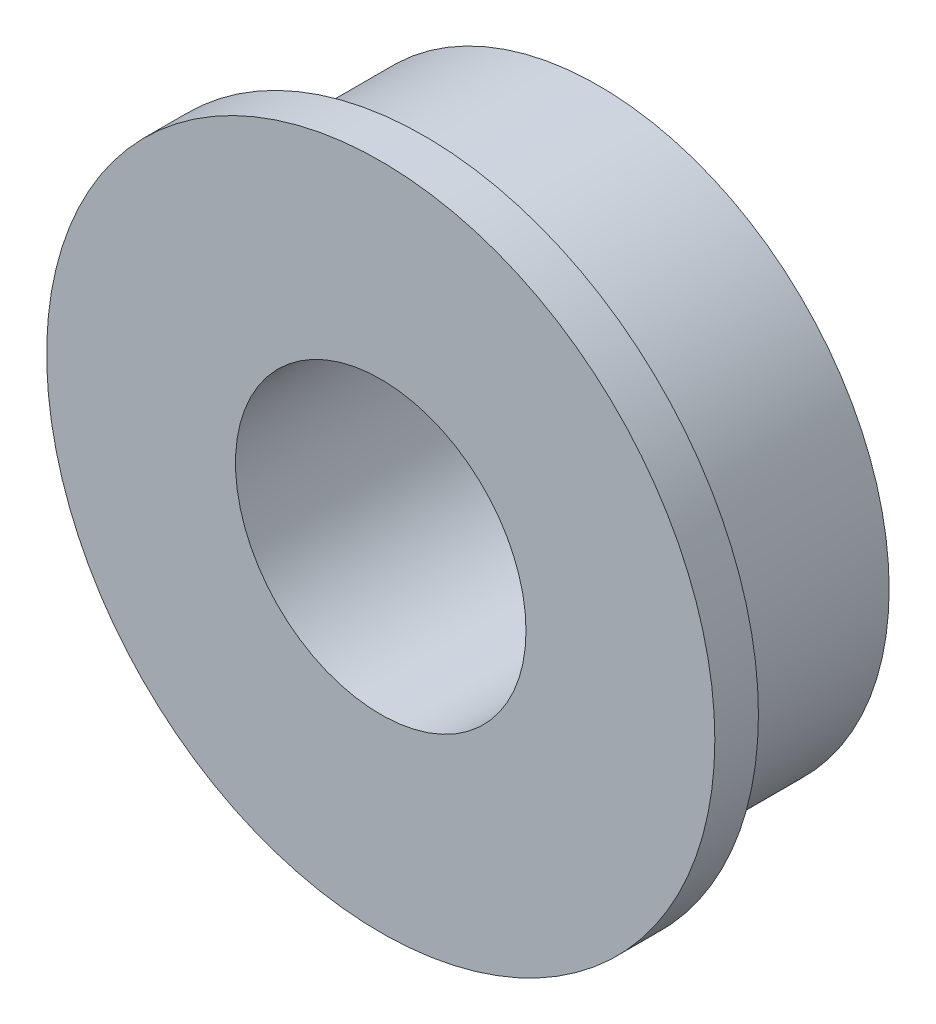
ISO-10303-21;
HEADER;
FILE_DESCRIPTION(('STEP AP214'),'2;1');
FILE_NAME('part.step','',(''),(''),'','','');
FILE_SCHEMA(('AUTOMOTIVE_DESIGN { 1 0 10303 214 1 1 1 1 }'));
ENDSEC;
DATA;
#1=APPLICATION_CONTEXT('core data for automotive mechanical design processes');
#2=APPLICATION_PROTOCOL_DEFINITION('international standard','automotive_design',2000,#1);
#3=PRODUCT_CONTEXT('',#1,'mechanical');
#4=PRODUCT('Part','Part','',(#3));
#5=PRODUCT_RELATED_PRODUCT_CATEGORY('part','',(#4));
#6=PRODUCT_DEFINITION_FORMATION('','',#4);
#7=PRODUCT_DEFINITION_CONTEXT('part definition',#1,'design');
#8=PRODUCT_DEFINITION('design','',#6,#7);
#9=PRODUCT_DEFINITION_SHAPE('','',#8);
#10=(LENGTH_UNIT() NAMED_UNIT(*) SI_UNIT(.MILLI.,.METRE.));
#11=(NAMED_UNIT(*) PLANE_ANGLE_UNIT() SI_UNIT($,.RADIAN.));
#12=(NAMED_UNIT(*) SI_UNIT($,.STERADIAN.) SOLID_ANGLE_UNIT());
#13=UNCERTAINTY_MEASURE_WITH_UNIT(LENGTH_MEASURE(1.E-05),#10,'distance_accuracy_value','');
#14=(GEOMETRIC_REPRESENTATION_CONTEXT(3) GLOBAL_UNCERTAINTY_ASSIGNED_CONTEXT((#13)) GLOBAL_UNIT_ASSIGNED_CONTEXT((#10,
#11,#12)) REPRESENTATION_CONTEXT('',''));
#15=CARTESIAN_POINT('',(0.,0.,0.));
#16=DIRECTION('',(0.,0.,1.));
#17=DIRECTION('',(1.,0.,0.));
#18=AXIS2_PLACEMENT_3D('',#15,#16,#17);
#19=CARTESIAN_POINT('',(0.,0.,-3.));
#20=DIRECTION('',(0.,0.,1.));
#21=DIRECTION('',(1.,0.,0.));
#22=AXIS2_PLACEMENT_3D('',#19,#20,#21);
#23=CYLINDRICAL_SURFACE('',#22,4.);
#24=CARTESIAN_POINT('',(0.,0.,-3.));
#25=DIRECTION('',(0.,0.,1.));
#26=DIRECTION('',(1.,0.,0.));
#27=AXIS2_PLACEMENT_3D('',#24,#25,#26);
#28=CIRCLE('',#27,4.);
#29=CARTESIAN_POINT('',(4.,0.,-3.));
#30=VERTEX_POINT('',#29);
#31=EDGE_CURVE('E10',#30,#30,#28,.T.);
#32=ORIENTED_EDGE('',*,*,#31,.T.);
#33=EDGE_LOOP('',(#32));
#34=FACE_BOUND('',#33,.T.);
#35=CARTESIAN_POINT('',(0.,0.,-0.6));
#36=DIRECTION('',(0.,0.,1.));
#37=DIRECTION('',(1.,0.,0.));
#38=AXIS2_PLACEMENT_3D('',#35,#36,#37);
#39=CIRCLE('',#38,4.);
#40=CARTESIAN_POINT('',(4.,0.,-0.6));
#41=VERTEX_POINT('',#40);
#42=EDGE_CURVE('E47',#41,#41,#39,.F.);
#43=ORIENTED_EDGE('',*,*,#42,.T.);
#44=EDGE_LOOP('',(#43));
#45=FACE_BOUND('',#44,.T.);
#46=ADVANCED_FACE('F32',(#34,#45),#23,.T.);
#47=CARTESIAN_POINT('',(0.,0.,-3.));
#48=DIRECTION('',(0.,0.,1.));
#49=DIRECTION('',(1.,0.,0.));
#50=AXIS2_PLACEMENT_3D('',#47,#48,#49);
#51=PLANE('',#50);
#52=CARTESIAN_POINT('',(0.,0.,-3.));
#53=DIRECTION('',(0.,0.,1.));
#54=DIRECTION('',(1.,0.,0.));
#55=AXIS2_PLACEMENT_3D('',#52,#53,#54);
#56=CIRCLE('',#55,2.);
#57=CARTESIAN_POINT('',(2.,0.,-3.));
#58=VERTEX_POINT('',#57);
#59=EDGE_CURVE('E38',#58,#58,#56,.T.);
#60=ORIENTED_EDGE('',*,*,#59,.T.);
#61=EDGE_LOOP('',(#60));
#62=FACE_BOUND('',#61,.T.);
#63=ORIENTED_EDGE('',*,*,#31,.F.);
#64=EDGE_LOOP('',(#63));
#65=FACE_BOUND('',#64,.T.);
#66=ADVANCED_FACE('F72',(#62,#65),#51,.F.);
#67=CARTESIAN_POINT('',(0.,0.,0.));
#68=DIRECTION('',(0.,0.,1.));
#69=DIRECTION('',(1.,0.,0.));
#70=AXIS2_PLACEMENT_3D('',#67,#68,#69);
#71=PLANE('',#70);
#72=CARTESIAN_POINT('',(0.,0.,0.));
#73=DIRECTION('',(0.,0.,1.));
#74=DIRECTION('',(1.,0.,0.));
#75=AXIS2_PLACEMENT_3D('',#72,#73,#74);
#76=CIRCLE('',#75,2.);
#77=CARTESIAN_POINT('',(2.,0.,0.));
#78=VERTEX_POINT('',#77);
#79=EDGE_CURVE('E42',#78,#78,#76,.T.);
#80=ORIENTED_EDGE('',*,*,#79,.F.);
#81=EDGE_LOOP('',(#80));
#82=FACE_BOUND('',#81,.T.);
#83=CARTESIAN_POINT('',(0.,0.,0.));
#84=DIRECTION('',(0.,0.,1.));
#85=DIRECTION('',(1.,0.,0.));
#86=AXIS2_PLACEMENT_3D('',#83,#84,#85);
#87=CIRCLE('',#86,4.6);
#88=CARTESIAN_POINT('',(4.6,0.,0.));
#89=VERTEX_POINT('',#88);
#90=EDGE_CURVE('E52',#89,#89,#87,.T.);
#91=ORIENTED_EDGE('',*,*,#90,.T.);
#92=EDGE_LOOP('',(#91));
#93=FACE_BOUND('',#92,.T.);
#94=ADVANCED_FACE('F76',(#82,#93),#71,.T.);
#95=CARTESIAN_POINT('',(0.,0.,-3.));
#96=DIRECTION('',(0.,0.,1.));
#97=DIRECTION('',(1.,0.,0.));
#98=AXIS2_PLACEMENT_3D('',#95,#96,#97);
#99=CYLINDRICAL_SURFACE('',#98,2.);
#100=ORIENTED_EDGE('',*,*,#79,.T.);
#101=EDGE_LOOP('',(#100));
#102=FACE_BOUND('',#101,.T.);
#103=ORIENTED_EDGE('',*,*,#59,.F.);
#104=EDGE_LOOP('',(#103));
#105=FACE_BOUND('',#104,.T.);
#106=ADVANCED_FACE('F68',(#102,#105),#99,.F.);
#107=CARTESIAN_POINT('',(0.,0.,-0.6));
#108=DIRECTION('',(0.,0.,1.));
#109=DIRECTION('',(1.,0.,0.));
#110=AXIS2_PLACEMENT_3D('',#107,#108,#109);
#111=CYLINDRICAL_SURFACE('',#110,4.6);
#112=CARTESIAN_POINT('',(0.,0.,-0.6));
#113=DIRECTION('',(0.,0.,1.));
#114=DIRECTION('',(1.,0.,0.));
#115=AXIS2_PLACEMENT_3D('',#112,#113,#114);
#116=CIRCLE('',#115,4.6);
#117=CARTESIAN_POINT('',(4.6,0.,-0.6));
#118=VERTEX_POINT('',#117);
#119=EDGE_CURVE('E51',#118,#118,#116,.T.);
#120=ORIENTED_EDGE('',*,*,#119,.T.);
#121=EDGE_LOOP('',(#120));
#122=FACE_BOUND('',#121,.T.);
#123=ORIENTED_EDGE('',*,*,#90,.F.);
#124=EDGE_LOOP('',(#123));
#125=FACE_BOUND('',#124,.T.);
#126=ADVANCED_FACE('F58',(#122,#125),#111,.T.);
#127=CARTESIAN_POINT('',(0.,0.,-0.6));
#128=DIRECTION('',(0.,0.,1.));
#129=DIRECTION('',(1.,0.,0.));
#130=AXIS2_PLACEMENT_3D('',#127,#128,#129);
#131=PLANE('',#130);
#132=ORIENTED_EDGE('',*,*,#42,.F.);
#133=EDGE_LOOP('',(#132));
#134=FACE_BOUND('',#133,.T.);
#135=ORIENTED_EDGE('',*,*,#119,.F.);
#136=EDGE_LOOP('',(#135));
#137=FACE_BOUND('',#136,.T.);
#138=ADVANCED_FACE('F61',(#134,#137),#131,.F.);
#139=CLOSED_SHELL('',(#46,#66,#94,#106,#126,#138));
#140=MANIFOLD_SOLID_BREP('B2',#139);
#141=ADVANCED_BREP_SHAPE_REPRESENTATION('',(#18,#140),#14);
#142=SHAPE_DEFINITION_REPRESENTATION(#9,#141);
ENDSEC;
END-ISO-10303-21;
